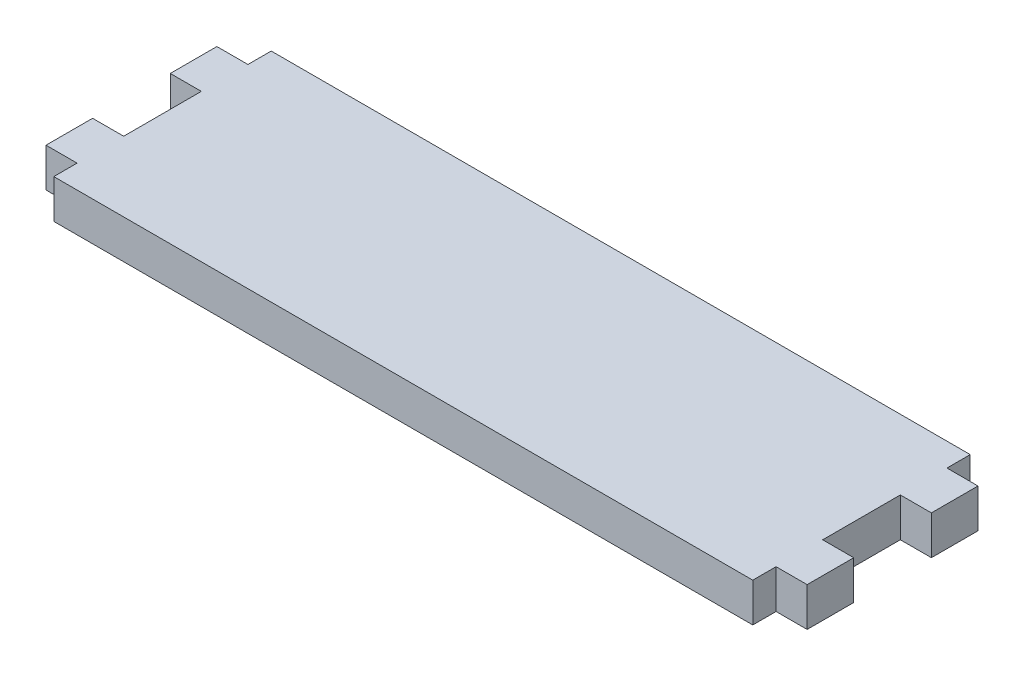
ISO-10303-21;
HEADER;
FILE_DESCRIPTION(('STEP AP214'),'2;1');
FILE_NAME('part.step','',(''),(''),'','','');
FILE_SCHEMA(('AUTOMOTIVE_DESIGN { 1 0 10303 214 1 1 1 1 }'));
ENDSEC;
DATA;
#1=APPLICATION_CONTEXT('core data for automotive mechanical design processes');
#2=APPLICATION_PROTOCOL_DEFINITION('international standard','automotive_design',2000,#1);
#3=PRODUCT_CONTEXT('',#1,'mechanical');
#4=PRODUCT('Part','Part','',(#3));
#5=PRODUCT_RELATED_PRODUCT_CATEGORY('part','',(#4));
#6=PRODUCT_DEFINITION_FORMATION('','',#4);
#7=PRODUCT_DEFINITION_CONTEXT('part definition',#1,'design');
#8=PRODUCT_DEFINITION('design','',#6,#7);
#9=PRODUCT_DEFINITION_SHAPE('','',#8);
#10=(LENGTH_UNIT() NAMED_UNIT(*) SI_UNIT(.MILLI.,.METRE.));
#11=(NAMED_UNIT(*) PLANE_ANGLE_UNIT() SI_UNIT($,.RADIAN.));
#12=(NAMED_UNIT(*) SI_UNIT($,.STERADIAN.) SOLID_ANGLE_UNIT());
#13=UNCERTAINTY_MEASURE_WITH_UNIT(LENGTH_MEASURE(1.E-05),#10,'distance_accuracy_value','');
#14=(GEOMETRIC_REPRESENTATION_CONTEXT(3) GLOBAL_UNCERTAINTY_ASSIGNED_CONTEXT((#13)) GLOBAL_UNIT_ASSIGNED_CONTEXT((#10,
#11,#12)) REPRESENTATION_CONTEXT('',''));
#15=CARTESIAN_POINT('',(0.,0.,0.));
#16=DIRECTION('',(0.,0.,1.));
#17=DIRECTION('',(1.,0.,0.));
#18=AXIS2_PLACEMENT_3D('',#15,#16,#17);
#19=CARTESIAN_POINT('',(90.,5.,0.));
#20=DIRECTION('',(0.,0.,-1.));
#21=DIRECTION('',(-1.,0.,0.));
#22=AXIS2_PLACEMENT_3D('',#19,#20,#21);
#23=PLANE('',#22);
#24=DIRECTION('',(1.,0.,0.));
#25=VECTOR('',#24,1.);
#26=CARTESIAN_POINT('',(90.,0.,0.));
#27=LINE('',#26,#25);
#28=CARTESIAN_POINT('',(0.,0.,0.));
#29=VERTEX_POINT('',#28);
#30=CARTESIAN_POINT('',(90.,0.,0.));
#31=VERTEX_POINT('',#30);
#32=EDGE_CURVE('E205',#29,#31,#27,.T.);
#33=ORIENTED_EDGE('',*,*,#32,.T.);
#34=DIRECTION('',(0.,-1.,0.));
#35=VECTOR('',#34,1.);
#36=CARTESIAN_POINT('',(90.,5.,0.));
#37=LINE('',#36,#35);
#38=CARTESIAN_POINT('',(90.,5.,0.));
#39=VERTEX_POINT('',#38);
#40=EDGE_CURVE('E11',#39,#31,#37,.T.);
#41=ORIENTED_EDGE('',*,*,#40,.F.);
#42=DIRECTION('',(1.,0.,0.));
#43=VECTOR('',#42,1.);
#44=CARTESIAN_POINT('',(90.,5.,0.));
#45=LINE('',#44,#43);
#46=CARTESIAN_POINT('',(0.,5.,0.));
#47=VERTEX_POINT('',#46);
#48=EDGE_CURVE('E243',#47,#39,#45,.T.);
#49=ORIENTED_EDGE('',*,*,#48,.F.);
#50=DIRECTION('',(0.,-1.,0.));
#51=VECTOR('',#50,1.);
#52=CARTESIAN_POINT('',(0.,5.,0.));
#53=LINE('',#52,#51);
#54=EDGE_CURVE('E201',#47,#29,#53,.T.);
#55=ORIENTED_EDGE('',*,*,#54,.T.);
#56=EDGE_LOOP('',(#33,#41,#49,#55));
#57=FACE_BOUND('',#56,.T.);
#58=ADVANCED_FACE('F37',(#57),#23,.F.);
#59=CARTESIAN_POINT('',(90.,5.,-3.));
#60=DIRECTION('',(-1.,0.,0.));
#61=DIRECTION('',(0.,0.,1.));
#62=AXIS2_PLACEMENT_3D('',#59,#60,#61);
#63=PLANE('',#62);
#64=DIRECTION('',(0.,0.,-1.));
#65=VECTOR('',#64,1.);
#66=CARTESIAN_POINT('',(90.,0.,-3.));
#67=LINE('',#66,#65);
#68=CARTESIAN_POINT('',(90.,0.,-3.));
#69=VERTEX_POINT('',#68);
#70=EDGE_CURVE('E208',#31,#69,#67,.T.);
#71=ORIENTED_EDGE('',*,*,#70,.T.);
#72=DIRECTION('',(0.,-1.,0.));
#73=VECTOR('',#72,1.);
#74=CARTESIAN_POINT('',(90.,5.,-3.));
#75=LINE('',#74,#73);
#76=CARTESIAN_POINT('',(90.,5.,-3.));
#77=VERTEX_POINT('',#76);
#78=EDGE_CURVE('E45',#77,#69,#75,.T.);
#79=ORIENTED_EDGE('',*,*,#78,.F.);
#80=DIRECTION('',(0.,0.,-1.));
#81=VECTOR('',#80,1.);
#82=CARTESIAN_POINT('',(90.,5.,-3.));
#83=LINE('',#82,#81);
#84=EDGE_CURVE('E132',#39,#77,#83,.T.);
#85=ORIENTED_EDGE('',*,*,#84,.F.);
#86=ORIENTED_EDGE('',*,*,#40,.T.);
#87=EDGE_LOOP('',(#71,#79,#85,#86));
#88=FACE_BOUND('',#87,.T.);
#89=ADVANCED_FACE('F361',(#88),#63,.F.);
#90=CARTESIAN_POINT('',(94.,5.,-3.));
#91=DIRECTION('',(0.,0.,-1.));
#92=DIRECTION('',(-1.,0.,0.));
#93=AXIS2_PLACEMENT_3D('',#90,#91,#92);
#94=PLANE('',#93);
#95=DIRECTION('',(1.,0.,0.));
#96=VECTOR('',#95,1.);
#97=CARTESIAN_POINT('',(94.,0.,-3.));
#98=LINE('',#97,#96);
#99=CARTESIAN_POINT('',(94.,0.,-3.));
#100=VERTEX_POINT('',#99);
#101=EDGE_CURVE('E210',#69,#100,#98,.T.);
#102=ORIENTED_EDGE('',*,*,#101,.T.);
#103=DIRECTION('',(0.,-1.,0.));
#104=VECTOR('',#103,1.);
#105=CARTESIAN_POINT('',(94.,5.,-3.));
#106=LINE('',#105,#104);
#107=CARTESIAN_POINT('',(94.,5.,-3.));
#108=VERTEX_POINT('',#107);
#109=EDGE_CURVE('E286',#108,#100,#106,.T.);
#110=ORIENTED_EDGE('',*,*,#109,.F.);
#111=DIRECTION('',(1.,0.,0.));
#112=VECTOR('',#111,1.);
#113=CARTESIAN_POINT('',(94.,5.,-3.));
#114=LINE('',#113,#112);
#115=EDGE_CURVE('E294',#77,#108,#114,.T.);
#116=ORIENTED_EDGE('',*,*,#115,.F.);
#117=ORIENTED_EDGE('',*,*,#78,.T.);
#118=EDGE_LOOP('',(#102,#110,#116,#117));
#119=FACE_BOUND('',#118,.T.);
#120=ADVANCED_FACE('F292',(#119),#94,.F.);
#121=CARTESIAN_POINT('',(94.,5.,-9.));
#122=DIRECTION('',(-1.,0.,0.));
#123=DIRECTION('',(0.,0.,1.));
#124=AXIS2_PLACEMENT_3D('',#121,#122,#123);
#125=PLANE('',#124);
#126=DIRECTION('',(0.,0.,-1.));
#127=VECTOR('',#126,1.);
#128=CARTESIAN_POINT('',(94.,0.,-9.));
#129=LINE('',#128,#127);
#130=CARTESIAN_POINT('',(94.,0.,-9.));
#131=VERTEX_POINT('',#130);
#132=EDGE_CURVE('E212',#100,#131,#129,.T.);
#133=ORIENTED_EDGE('',*,*,#132,.T.);
#134=DIRECTION('',(0.,-1.,0.));
#135=VECTOR('',#134,1.);
#136=CARTESIAN_POINT('',(94.,5.,-9.));
#137=LINE('',#136,#135);
#138=CARTESIAN_POINT('',(94.,5.,-9.));
#139=VERTEX_POINT('',#138);
#140=EDGE_CURVE('E283',#139,#131,#137,.T.);
#141=ORIENTED_EDGE('',*,*,#140,.F.);
#142=DIRECTION('',(0.,0.,-1.));
#143=VECTOR('',#142,1.);
#144=CARTESIAN_POINT('',(94.,5.,-9.));
#145=LINE('',#144,#143);
#146=EDGE_CURVE('E312',#108,#139,#145,.T.);
#147=ORIENTED_EDGE('',*,*,#146,.F.);
#148=ORIENTED_EDGE('',*,*,#109,.T.);
#149=EDGE_LOOP('',(#133,#141,#147,#148));
#150=FACE_BOUND('',#149,.T.);
#151=ADVANCED_FACE('F303',(#150),#125,.F.);
#152=CARTESIAN_POINT('',(90.,5.,-9.));
#153=DIRECTION('',(0.,0.,1.));
#154=DIRECTION('',(1.,0.,0.));
#155=AXIS2_PLACEMENT_3D('',#152,#153,#154);
#156=PLANE('',#155);
#157=DIRECTION('',(-1.,0.,0.));
#158=VECTOR('',#157,1.);
#159=CARTESIAN_POINT('',(90.,0.,-9.));
#160=LINE('',#159,#158);
#161=CARTESIAN_POINT('',(90.,0.,-9.));
#162=VERTEX_POINT('',#161);
#163=EDGE_CURVE('E214',#131,#162,#160,.T.);
#164=ORIENTED_EDGE('',*,*,#163,.T.);
#165=DIRECTION('',(0.,-1.,0.));
#166=VECTOR('',#165,1.);
#167=CARTESIAN_POINT('',(90.,5.,-9.));
#168=LINE('',#167,#166);
#169=CARTESIAN_POINT('',(90.,5.,-9.));
#170=VERTEX_POINT('',#169);
#171=EDGE_CURVE('E280',#170,#162,#168,.T.);
#172=ORIENTED_EDGE('',*,*,#171,.F.);
#173=DIRECTION('',(-1.,0.,0.));
#174=VECTOR('',#173,1.);
#175=CARTESIAN_POINT('',(90.,5.,-9.));
#176=LINE('',#175,#174);
#177=EDGE_CURVE('E309',#139,#170,#176,.T.);
#178=ORIENTED_EDGE('',*,*,#177,.F.);
#179=ORIENTED_EDGE('',*,*,#140,.T.);
#180=EDGE_LOOP('',(#164,#172,#178,#179));
#181=FACE_BOUND('',#180,.T.);
#182=ADVANCED_FACE('F307',(#181),#156,.F.);
#183=CARTESIAN_POINT('',(90.,5.,-19.));
#184=DIRECTION('',(-1.,0.,0.));
#185=DIRECTION('',(0.,0.,1.));
#186=AXIS2_PLACEMENT_3D('',#183,#184,#185);
#187=PLANE('',#186);
#188=DIRECTION('',(0.,0.,-1.));
#189=VECTOR('',#188,1.);
#190=CARTESIAN_POINT('',(90.,0.,-19.));
#191=LINE('',#190,#189);
#192=CARTESIAN_POINT('',(90.,0.,-19.));
#193=VERTEX_POINT('',#192);
#194=EDGE_CURVE('E216',#162,#193,#191,.T.);
#195=ORIENTED_EDGE('',*,*,#194,.T.);
#196=DIRECTION('',(0.,-1.,0.));
#197=VECTOR('',#196,1.);
#198=CARTESIAN_POINT('',(90.,5.,-19.));
#199=LINE('',#198,#197);
#200=CARTESIAN_POINT('',(90.,5.,-19.));
#201=VERTEX_POINT('',#200);
#202=EDGE_CURVE('E277',#201,#193,#199,.T.);
#203=ORIENTED_EDGE('',*,*,#202,.F.);
#204=DIRECTION('',(0.,0.,-1.));
#205=VECTOR('',#204,1.);
#206=CARTESIAN_POINT('',(90.,5.,-19.));
#207=LINE('',#206,#205);
#208=EDGE_CURVE('E311',#170,#201,#207,.T.);
#209=ORIENTED_EDGE('',*,*,#208,.F.);
#210=ORIENTED_EDGE('',*,*,#171,.T.);
#211=EDGE_LOOP('',(#195,#203,#209,#210));
#212=FACE_BOUND('',#211,.T.);
#213=ADVANCED_FACE('F374',(#212),#187,.F.);
#214=CARTESIAN_POINT('',(94.,5.,-19.));
#215=DIRECTION('',(0.,0.,-1.));
#216=DIRECTION('',(-1.,0.,0.));
#217=AXIS2_PLACEMENT_3D('',#214,#215,#216);
#218=PLANE('',#217);
#219=DIRECTION('',(1.,0.,0.));
#220=VECTOR('',#219,1.);
#221=CARTESIAN_POINT('',(94.,0.,-19.));
#222=LINE('',#221,#220);
#223=CARTESIAN_POINT('',(94.,0.,-19.));
#224=VERTEX_POINT('',#223);
#225=EDGE_CURVE('E218',#193,#224,#222,.T.);
#226=ORIENTED_EDGE('',*,*,#225,.T.);
#227=DIRECTION('',(0.,-1.,0.));
#228=VECTOR('',#227,1.);
#229=CARTESIAN_POINT('',(94.,5.,-19.));
#230=LINE('',#229,#228);
#231=CARTESIAN_POINT('',(94.,5.,-19.));
#232=VERTEX_POINT('',#231);
#233=EDGE_CURVE('E274',#232,#224,#230,.T.);
#234=ORIENTED_EDGE('',*,*,#233,.F.);
#235=DIRECTION('',(1.,0.,0.));
#236=VECTOR('',#235,1.);
#237=CARTESIAN_POINT('',(94.,5.,-19.));
#238=LINE('',#237,#236);
#239=EDGE_CURVE('E314',#201,#232,#238,.T.);
#240=ORIENTED_EDGE('',*,*,#239,.F.);
#241=ORIENTED_EDGE('',*,*,#202,.T.);
#242=EDGE_LOOP('',(#226,#234,#240,#241));
#243=FACE_BOUND('',#242,.T.);
#244=ADVANCED_FACE('F377',(#243),#218,.F.);
#245=CARTESIAN_POINT('',(94.,5.,-25.));
#246=DIRECTION('',(-1.,0.,0.));
#247=DIRECTION('',(0.,0.,1.));
#248=AXIS2_PLACEMENT_3D('',#245,#246,#247);
#249=PLANE('',#248);
#250=DIRECTION('',(0.,0.,-1.));
#251=VECTOR('',#250,1.);
#252=CARTESIAN_POINT('',(94.,0.,-25.));
#253=LINE('',#252,#251);
#254=CARTESIAN_POINT('',(94.,0.,-25.));
#255=VERTEX_POINT('',#254);
#256=EDGE_CURVE('E220',#224,#255,#253,.T.);
#257=ORIENTED_EDGE('',*,*,#256,.T.);
#258=DIRECTION('',(0.,-1.,0.));
#259=VECTOR('',#258,1.);
#260=CARTESIAN_POINT('',(94.,5.,-25.));
#261=LINE('',#260,#259);
#262=CARTESIAN_POINT('',(94.,5.,-25.));
#263=VERTEX_POINT('',#262);
#264=EDGE_CURVE('E271',#263,#255,#261,.T.);
#265=ORIENTED_EDGE('',*,*,#264,.F.);
#266=DIRECTION('',(0.,0.,-1.));
#267=VECTOR('',#266,1.);
#268=CARTESIAN_POINT('',(94.,5.,-25.));
#269=LINE('',#268,#267);
#270=EDGE_CURVE('E320',#232,#263,#269,.T.);
#271=ORIENTED_EDGE('',*,*,#270,.F.);
#272=ORIENTED_EDGE('',*,*,#233,.T.);
#273=EDGE_LOOP('',(#257,#265,#271,#272));
#274=FACE_BOUND('',#273,.T.);
#275=ADVANCED_FACE('F381',(#274),#249,.F.);
#276=CARTESIAN_POINT('',(90.,5.,-25.));
#277=DIRECTION('',(0.,0.,1.));
#278=DIRECTION('',(1.,0.,0.));
#279=AXIS2_PLACEMENT_3D('',#276,#277,#278);
#280=PLANE('',#279);
#281=DIRECTION('',(-1.,0.,0.));
#282=VECTOR('',#281,1.);
#283=CARTESIAN_POINT('',(90.,0.,-25.));
#284=LINE('',#283,#282);
#285=CARTESIAN_POINT('',(90.,0.,-25.));
#286=VERTEX_POINT('',#285);
#287=EDGE_CURVE('E222',#255,#286,#284,.T.);
#288=ORIENTED_EDGE('',*,*,#287,.T.);
#289=DIRECTION('',(0.,-1.,0.));
#290=VECTOR('',#289,1.);
#291=CARTESIAN_POINT('',(90.,5.,-25.));
#292=LINE('',#291,#290);
#293=CARTESIAN_POINT('',(90.,5.,-25.));
#294=VERTEX_POINT('',#293);
#295=EDGE_CURVE('E268',#294,#286,#292,.T.);
#296=ORIENTED_EDGE('',*,*,#295,.F.);
#297=DIRECTION('',(-1.,0.,0.));
#298=VECTOR('',#297,1.);
#299=CARTESIAN_POINT('',(90.,5.,-25.));
#300=LINE('',#299,#298);
#301=EDGE_CURVE('E322',#263,#294,#300,.T.);
#302=ORIENTED_EDGE('',*,*,#301,.F.);
#303=ORIENTED_EDGE('',*,*,#264,.T.);
#304=EDGE_LOOP('',(#288,#296,#302,#303));
#305=FACE_BOUND('',#304,.T.);
#306=ADVANCED_FACE('F385',(#305),#280,.F.);
#307=CARTESIAN_POINT('',(90.,5.,-28.));
#308=DIRECTION('',(-1.,0.,0.));
#309=DIRECTION('',(0.,0.,1.));
#310=AXIS2_PLACEMENT_3D('',#307,#308,#309);
#311=PLANE('',#310);
#312=DIRECTION('',(0.,0.,-1.));
#313=VECTOR('',#312,1.);
#314=CARTESIAN_POINT('',(90.,0.,-28.));
#315=LINE('',#314,#313);
#316=CARTESIAN_POINT('',(90.,0.,-28.));
#317=VERTEX_POINT('',#316);
#318=EDGE_CURVE('E224',#286,#317,#315,.T.);
#319=ORIENTED_EDGE('',*,*,#318,.T.);
#320=DIRECTION('',(0.,-1.,0.));
#321=VECTOR('',#320,1.);
#322=CARTESIAN_POINT('',(90.,5.,-28.));
#323=LINE('',#322,#321);
#324=CARTESIAN_POINT('',(90.,5.,-28.));
#325=VERTEX_POINT('',#324);
#326=EDGE_CURVE('E265',#325,#317,#323,.T.);
#327=ORIENTED_EDGE('',*,*,#326,.F.);
#328=DIRECTION('',(0.,0.,-1.));
#329=VECTOR('',#328,1.);
#330=CARTESIAN_POINT('',(90.,5.,-28.));
#331=LINE('',#330,#329);
#332=EDGE_CURVE('E324',#294,#325,#331,.T.);
#333=ORIENTED_EDGE('',*,*,#332,.F.);
#334=ORIENTED_EDGE('',*,*,#295,.T.);
#335=EDGE_LOOP('',(#319,#327,#333,#334));
#336=FACE_BOUND('',#335,.T.);
#337=ADVANCED_FACE('F389',(#336),#311,.F.);
#338=CARTESIAN_POINT('',(0.,5.,-28.));
#339=DIRECTION('',(0.,0.,1.));
#340=DIRECTION('',(1.,0.,0.));
#341=AXIS2_PLACEMENT_3D('',#338,#339,#340);
#342=PLANE('',#341);
#343=DIRECTION('',(-1.,0.,0.));
#344=VECTOR('',#343,1.);
#345=CARTESIAN_POINT('',(0.,0.,-28.));
#346=LINE('',#345,#344);
#347=CARTESIAN_POINT('',(0.,0.,-28.));
#348=VERTEX_POINT('',#347);
#349=EDGE_CURVE('E226',#317,#348,#346,.T.);
#350=ORIENTED_EDGE('',*,*,#349,.T.);
#351=DIRECTION('',(0.,-1.,0.));
#352=VECTOR('',#351,1.);
#353=CARTESIAN_POINT('',(0.,5.,-28.));
#354=LINE('',#353,#352);
#355=CARTESIAN_POINT('',(0.,5.,-28.));
#356=VERTEX_POINT('',#355);
#357=EDGE_CURVE('E262',#356,#348,#354,.T.);
#358=ORIENTED_EDGE('',*,*,#357,.F.);
#359=DIRECTION('',(-1.,0.,0.));
#360=VECTOR('',#359,1.);
#361=CARTESIAN_POINT('',(0.,5.,-28.));
#362=LINE('',#361,#360);
#363=EDGE_CURVE('E326',#325,#356,#362,.T.);
#364=ORIENTED_EDGE('',*,*,#363,.F.);
#365=ORIENTED_EDGE('',*,*,#326,.T.);
#366=EDGE_LOOP('',(#350,#358,#364,#365));
#367=FACE_BOUND('',#366,.T.);
#368=ADVANCED_FACE('F393',(#367),#342,.F.);
#369=CARTESIAN_POINT('',(0.,5.,-25.));
#370=DIRECTION('',(1.,0.,0.));
#371=DIRECTION('',(0.,0.,-1.));
#372=AXIS2_PLACEMENT_3D('',#369,#370,#371);
#373=PLANE('',#372);
#374=DIRECTION('',(0.,0.,1.));
#375=VECTOR('',#374,1.);
#376=CARTESIAN_POINT('',(0.,0.,-25.));
#377=LINE('',#376,#375);
#378=CARTESIAN_POINT('',(0.,0.,-25.));
#379=VERTEX_POINT('',#378);
#380=EDGE_CURVE('E228',#348,#379,#377,.T.);
#381=ORIENTED_EDGE('',*,*,#380,.T.);
#382=DIRECTION('',(0.,-1.,0.));
#383=VECTOR('',#382,1.);
#384=CARTESIAN_POINT('',(0.,5.,-25.));
#385=LINE('',#384,#383);
#386=CARTESIAN_POINT('',(0.,5.,-25.));
#387=VERTEX_POINT('',#386);
#388=EDGE_CURVE('E259',#387,#379,#385,.T.);
#389=ORIENTED_EDGE('',*,*,#388,.F.);
#390=DIRECTION('',(0.,0.,1.));
#391=VECTOR('',#390,1.);
#392=CARTESIAN_POINT('',(0.,5.,-25.));
#393=LINE('',#392,#391);
#394=EDGE_CURVE('E328',#356,#387,#393,.T.);
#395=ORIENTED_EDGE('',*,*,#394,.F.);
#396=ORIENTED_EDGE('',*,*,#357,.T.);
#397=EDGE_LOOP('',(#381,#389,#395,#396));
#398=FACE_BOUND('',#397,.T.);
#399=ADVANCED_FACE('F397',(#398),#373,.F.);
#400=CARTESIAN_POINT('',(-4.,5.,-25.));
#401=DIRECTION('',(0.,0.,1.));
#402=DIRECTION('',(1.,0.,0.));
#403=AXIS2_PLACEMENT_3D('',#400,#401,#402);
#404=PLANE('',#403);
#405=DIRECTION('',(-1.,0.,0.));
#406=VECTOR('',#405,1.);
#407=CARTESIAN_POINT('',(-4.,0.,-25.));
#408=LINE('',#407,#406);
#409=CARTESIAN_POINT('',(-4.,0.,-25.));
#410=VERTEX_POINT('',#409);
#411=EDGE_CURVE('E230',#379,#410,#408,.T.);
#412=ORIENTED_EDGE('',*,*,#411,.T.);
#413=DIRECTION('',(0.,-1.,0.));
#414=VECTOR('',#413,1.);
#415=CARTESIAN_POINT('',(-4.,5.,-25.));
#416=LINE('',#415,#414);
#417=CARTESIAN_POINT('',(-4.,5.,-25.));
#418=VERTEX_POINT('',#417);
#419=EDGE_CURVE('E256',#418,#410,#416,.T.);
#420=ORIENTED_EDGE('',*,*,#419,.F.);
#421=DIRECTION('',(-1.,0.,0.));
#422=VECTOR('',#421,1.);
#423=CARTESIAN_POINT('',(-4.,5.,-25.));
#424=LINE('',#423,#422);
#425=EDGE_CURVE('E330',#387,#418,#424,.T.);
#426=ORIENTED_EDGE('',*,*,#425,.F.);
#427=ORIENTED_EDGE('',*,*,#388,.T.);
#428=EDGE_LOOP('',(#412,#420,#426,#427));
#429=FACE_BOUND('',#428,.T.);
#430=ADVANCED_FACE('F401',(#429),#404,.F.);
#431=CARTESIAN_POINT('',(-4.,5.,-19.));
#432=DIRECTION('',(1.,0.,0.));
#433=DIRECTION('',(0.,0.,-1.));
#434=AXIS2_PLACEMENT_3D('',#431,#432,#433);
#435=PLANE('',#434);
#436=DIRECTION('',(0.,0.,1.));
#437=VECTOR('',#436,1.);
#438=CARTESIAN_POINT('',(-4.,0.,-19.));
#439=LINE('',#438,#437);
#440=CARTESIAN_POINT('',(-4.,0.,-19.));
#441=VERTEX_POINT('',#440);
#442=EDGE_CURVE('E232',#410,#441,#439,.T.);
#443=ORIENTED_EDGE('',*,*,#442,.T.);
#444=DIRECTION('',(0.,-1.,0.));
#445=VECTOR('',#444,1.);
#446=CARTESIAN_POINT('',(-4.,5.,-19.));
#447=LINE('',#446,#445);
#448=CARTESIAN_POINT('',(-4.,5.,-19.));
#449=VERTEX_POINT('',#448);
#450=EDGE_CURVE('E253',#449,#441,#447,.T.);
#451=ORIENTED_EDGE('',*,*,#450,.F.);
#452=DIRECTION('',(0.,0.,1.));
#453=VECTOR('',#452,1.);
#454=CARTESIAN_POINT('',(-4.,5.,-19.));
#455=LINE('',#454,#453);
#456=EDGE_CURVE('E332',#418,#449,#455,.T.);
#457=ORIENTED_EDGE('',*,*,#456,.F.);
#458=ORIENTED_EDGE('',*,*,#419,.T.);
#459=EDGE_LOOP('',(#443,#451,#457,#458));
#460=FACE_BOUND('',#459,.T.);
#461=ADVANCED_FACE('F405',(#460),#435,.F.);
#462=CARTESIAN_POINT('',(0.,5.,-19.));
#463=DIRECTION('',(0.,0.,-1.));
#464=DIRECTION('',(-1.,0.,0.));
#465=AXIS2_PLACEMENT_3D('',#462,#463,#464);
#466=PLANE('',#465);
#467=DIRECTION('',(1.,0.,0.));
#468=VECTOR('',#467,1.);
#469=CARTESIAN_POINT('',(0.,0.,-19.));
#470=LINE('',#469,#468);
#471=CARTESIAN_POINT('',(0.,0.,-19.));
#472=VERTEX_POINT('',#471);
#473=EDGE_CURVE('E234',#441,#472,#470,.T.);
#474=ORIENTED_EDGE('',*,*,#473,.T.);
#475=DIRECTION('',(0.,-1.,0.));
#476=VECTOR('',#475,1.);
#477=CARTESIAN_POINT('',(0.,5.,-19.));
#478=LINE('',#477,#476);
#479=CARTESIAN_POINT('',(0.,5.,-19.));
#480=VERTEX_POINT('',#479);
#481=EDGE_CURVE('E250',#480,#472,#478,.T.);
#482=ORIENTED_EDGE('',*,*,#481,.F.);
#483=DIRECTION('',(1.,0.,0.));
#484=VECTOR('',#483,1.);
#485=CARTESIAN_POINT('',(0.,5.,-19.));
#486=LINE('',#485,#484);
#487=EDGE_CURVE('E334',#449,#480,#486,.T.);
#488=ORIENTED_EDGE('',*,*,#487,.F.);
#489=ORIENTED_EDGE('',*,*,#450,.T.);
#490=EDGE_LOOP('',(#474,#482,#488,#489));
#491=FACE_BOUND('',#490,.T.);
#492=ADVANCED_FACE('F409',(#491),#466,.F.);
#493=CARTESIAN_POINT('',(0.,5.,-9.));
#494=DIRECTION('',(1.,0.,0.));
#495=DIRECTION('',(0.,0.,-1.));
#496=AXIS2_PLACEMENT_3D('',#493,#494,#495);
#497=PLANE('',#496);
#498=DIRECTION('',(0.,0.,1.));
#499=VECTOR('',#498,1.);
#500=CARTESIAN_POINT('',(0.,0.,-9.));
#501=LINE('',#500,#499);
#502=CARTESIAN_POINT('',(0.,0.,-9.));
#503=VERTEX_POINT('',#502);
#504=EDGE_CURVE('E236',#472,#503,#501,.T.);
#505=ORIENTED_EDGE('',*,*,#504,.T.);
#506=DIRECTION('',(0.,-1.,0.));
#507=VECTOR('',#506,1.);
#508=CARTESIAN_POINT('',(0.,5.,-9.));
#509=LINE('',#508,#507);
#510=CARTESIAN_POINT('',(0.,5.,-9.));
#511=VERTEX_POINT('',#510);
#512=EDGE_CURVE('E247',#511,#503,#509,.T.);
#513=ORIENTED_EDGE('',*,*,#512,.F.);
#514=DIRECTION('',(0.,0.,1.));
#515=VECTOR('',#514,1.);
#516=CARTESIAN_POINT('',(0.,5.,-9.));
#517=LINE('',#516,#515);
#518=EDGE_CURVE('E336',#480,#511,#517,.T.);
#519=ORIENTED_EDGE('',*,*,#518,.F.);
#520=ORIENTED_EDGE('',*,*,#481,.T.);
#521=EDGE_LOOP('',(#505,#513,#519,#520));
#522=FACE_BOUND('',#521,.T.);
#523=ADVANCED_FACE('F342',(#522),#497,.F.);
#524=CARTESIAN_POINT('',(-4.,5.,-9.));
#525=DIRECTION('',(0.,0.,1.));
#526=DIRECTION('',(1.,0.,0.));
#527=AXIS2_PLACEMENT_3D('',#524,#525,#526);
#528=PLANE('',#527);
#529=DIRECTION('',(-1.,0.,0.));
#530=VECTOR('',#529,1.);
#531=CARTESIAN_POINT('',(-4.,0.,-9.));
#532=LINE('',#531,#530);
#533=CARTESIAN_POINT('',(-4.,0.,-9.));
#534=VERTEX_POINT('',#533);
#535=EDGE_CURVE('E238',#503,#534,#532,.T.);
#536=ORIENTED_EDGE('',*,*,#535,.T.);
#537=DIRECTION('',(0.,-1.,0.));
#538=VECTOR('',#537,1.);
#539=CARTESIAN_POINT('',(-4.,5.,-9.));
#540=LINE('',#539,#538);
#541=CARTESIAN_POINT('',(-4.,5.,-9.));
#542=VERTEX_POINT('',#541);
#543=EDGE_CURVE('E196',#542,#534,#540,.T.);
#544=ORIENTED_EDGE('',*,*,#543,.F.);
#545=DIRECTION('',(-1.,0.,0.));
#546=VECTOR('',#545,1.);
#547=CARTESIAN_POINT('',(-4.,5.,-9.));
#548=LINE('',#547,#546);
#549=EDGE_CURVE('E187',#511,#542,#548,.T.);
#550=ORIENTED_EDGE('',*,*,#549,.F.);
#551=ORIENTED_EDGE('',*,*,#512,.T.);
#552=EDGE_LOOP('',(#536,#544,#550,#551));
#553=FACE_BOUND('',#552,.T.);
#554=ADVANCED_FACE('F346',(#553),#528,.F.);
#555=CARTESIAN_POINT('',(-4.,5.,-3.));
#556=DIRECTION('',(1.,0.,0.));
#557=DIRECTION('',(0.,0.,-1.));
#558=AXIS2_PLACEMENT_3D('',#555,#556,#557);
#559=PLANE('',#558);
#560=DIRECTION('',(0.,0.,1.));
#561=VECTOR('',#560,1.);
#562=CARTESIAN_POINT('',(-4.,0.,-3.));
#563=LINE('',#562,#561);
#564=CARTESIAN_POINT('',(-4.,0.,-3.));
#565=VERTEX_POINT('',#564);
#566=EDGE_CURVE('E195',#534,#565,#563,.T.);
#567=ORIENTED_EDGE('',*,*,#566,.T.);
#568=DIRECTION('',(0.,-1.,0.));
#569=VECTOR('',#568,1.);
#570=CARTESIAN_POINT('',(-4.,5.,-3.));
#571=LINE('',#570,#569);
#572=CARTESIAN_POINT('',(-4.,5.,-3.));
#573=VERTEX_POINT('',#572);
#574=EDGE_CURVE('E192',#573,#565,#571,.T.);
#575=ORIENTED_EDGE('',*,*,#574,.F.);
#576=DIRECTION('',(0.,0.,1.));
#577=VECTOR('',#576,1.);
#578=CARTESIAN_POINT('',(-4.,5.,-3.));
#579=LINE('',#578,#577);
#580=EDGE_CURVE('E181',#542,#573,#579,.T.);
#581=ORIENTED_EDGE('',*,*,#580,.F.);
#582=ORIENTED_EDGE('',*,*,#543,.T.);
#583=EDGE_LOOP('',(#567,#575,#581,#582));
#584=FACE_BOUND('',#583,.T.);
#585=ADVANCED_FACE('F193',(#584),#559,.F.);
#586=CARTESIAN_POINT('',(0.,5.,-3.));
#587=DIRECTION('',(0.,0.,-1.));
#588=DIRECTION('',(-1.,0.,0.));
#589=AXIS2_PLACEMENT_3D('',#586,#587,#588);
#590=PLANE('',#589);
#591=DIRECTION('',(1.,0.,0.));
#592=VECTOR('',#591,1.);
#593=CARTESIAN_POINT('',(0.,0.,-3.));
#594=LINE('',#593,#592);
#595=CARTESIAN_POINT('',(0.,0.,-3.));
#596=VERTEX_POINT('',#595);
#597=EDGE_CURVE('E118',#565,#596,#594,.T.);
#598=ORIENTED_EDGE('',*,*,#597,.T.);
#599=DIRECTION('',(0.,-1.,0.));
#600=VECTOR('',#599,1.);
#601=CARTESIAN_POINT('',(0.,5.,-3.));
#602=LINE('',#601,#600);
#603=CARTESIAN_POINT('',(0.,5.,-3.));
#604=VERTEX_POINT('',#603);
#605=EDGE_CURVE('E197',#604,#596,#602,.T.);
#606=ORIENTED_EDGE('',*,*,#605,.F.);
#607=DIRECTION('',(1.,0.,0.));
#608=VECTOR('',#607,1.);
#609=CARTESIAN_POINT('',(0.,5.,-3.));
#610=LINE('',#609,#608);
#611=EDGE_CURVE('E185',#573,#604,#610,.T.);
#612=ORIENTED_EDGE('',*,*,#611,.F.);
#613=ORIENTED_EDGE('',*,*,#574,.T.);
#614=EDGE_LOOP('',(#598,#606,#612,#613));
#615=FACE_BOUND('',#614,.T.);
#616=ADVANCED_FACE('F199',(#615),#590,.F.);
#617=CARTESIAN_POINT('',(0.,5.,0.));
#618=DIRECTION('',(1.,0.,0.));
#619=DIRECTION('',(0.,0.,-1.));
#620=AXIS2_PLACEMENT_3D('',#617,#618,#619);
#621=PLANE('',#620);
#622=DIRECTION('',(0.,0.,1.));
#623=VECTOR('',#622,1.);
#624=CARTESIAN_POINT('',(0.,0.,0.));
#625=LINE('',#624,#623);
#626=EDGE_CURVE('E124',#596,#29,#625,.T.);
#627=ORIENTED_EDGE('',*,*,#626,.T.);
#628=ORIENTED_EDGE('',*,*,#54,.F.);
#629=DIRECTION('',(0.,0.,1.));
#630=VECTOR('',#629,1.);
#631=CARTESIAN_POINT('',(0.,5.,0.));
#632=LINE('',#631,#630);
#633=EDGE_CURVE('E53',#604,#47,#632,.T.);
#634=ORIENTED_EDGE('',*,*,#633,.F.);
#635=ORIENTED_EDGE('',*,*,#605,.T.);
#636=EDGE_LOOP('',(#627,#628,#634,#635));
#637=FACE_BOUND('',#636,.T.);
#638=ADVANCED_FACE('F350',(#637),#621,.F.);
#639=CARTESIAN_POINT('',(0.,5.,0.));
#640=DIRECTION('',(0.,-1.,0.));
#641=DIRECTION('',(0.,0.,-1.));
#642=AXIS2_PLACEMENT_3D('',#639,#640,#641);
#643=PLANE('',#642);
#644=ORIENTED_EDGE('',*,*,#48,.T.);
#645=ORIENTED_EDGE('',*,*,#84,.T.);
#646=ORIENTED_EDGE('',*,*,#115,.T.);
#647=ORIENTED_EDGE('',*,*,#146,.T.);
#648=ORIENTED_EDGE('',*,*,#177,.T.);
#649=ORIENTED_EDGE('',*,*,#208,.T.);
#650=ORIENTED_EDGE('',*,*,#239,.T.);
#651=ORIENTED_EDGE('',*,*,#270,.T.);
#652=ORIENTED_EDGE('',*,*,#301,.T.);
#653=ORIENTED_EDGE('',*,*,#332,.T.);
#654=ORIENTED_EDGE('',*,*,#363,.T.);
#655=ORIENTED_EDGE('',*,*,#394,.T.);
#656=ORIENTED_EDGE('',*,*,#425,.T.);
#657=ORIENTED_EDGE('',*,*,#456,.T.);
#658=ORIENTED_EDGE('',*,*,#487,.T.);
#659=ORIENTED_EDGE('',*,*,#518,.T.);
#660=ORIENTED_EDGE('',*,*,#549,.T.);
#661=ORIENTED_EDGE('',*,*,#580,.T.);
#662=ORIENTED_EDGE('',*,*,#611,.T.);
#663=ORIENTED_EDGE('',*,*,#633,.T.);
#664=EDGE_LOOP('',(#644,#645,#646,#647,#648,#649,#650,#651,#652,#653,#654,#655,#656,#657,#658,
#659,#660,#661,#662,#663));
#665=FACE_BOUND('',#664,.T.);
#666=ADVANCED_FACE('F183',(#665),#643,.F.);
#667=CARTESIAN_POINT('',(0.,0.,0.));
#668=DIRECTION('',(0.,-1.,0.));
#669=DIRECTION('',(0.,0.,-1.));
#670=AXIS2_PLACEMENT_3D('',#667,#668,#669);
#671=PLANE('',#670);
#672=ORIENTED_EDGE('',*,*,#32,.F.);
#673=ORIENTED_EDGE('',*,*,#626,.F.);
#674=ORIENTED_EDGE('',*,*,#597,.F.);
#675=ORIENTED_EDGE('',*,*,#566,.F.);
#676=ORIENTED_EDGE('',*,*,#535,.F.);
#677=ORIENTED_EDGE('',*,*,#504,.F.);
#678=ORIENTED_EDGE('',*,*,#473,.F.);
#679=ORIENTED_EDGE('',*,*,#442,.F.);
#680=ORIENTED_EDGE('',*,*,#411,.F.);
#681=ORIENTED_EDGE('',*,*,#380,.F.);
#682=ORIENTED_EDGE('',*,*,#349,.F.);
#683=ORIENTED_EDGE('',*,*,#318,.F.);
#684=ORIENTED_EDGE('',*,*,#287,.F.);
#685=ORIENTED_EDGE('',*,*,#256,.F.);
#686=ORIENTED_EDGE('',*,*,#225,.F.);
#687=ORIENTED_EDGE('',*,*,#194,.F.);
#688=ORIENTED_EDGE('',*,*,#163,.F.);
#689=ORIENTED_EDGE('',*,*,#132,.F.);
#690=ORIENTED_EDGE('',*,*,#101,.F.);
#691=ORIENTED_EDGE('',*,*,#70,.F.);
#692=EDGE_LOOP('',(#672,#673,#674,#675,#676,#677,#678,#679,#680,#681,#682,#683,#684,#685,#686,
#687,#688,#689,#690,#691));
#693=FACE_BOUND('',#692,.T.);
#694=ADVANCED_FACE('F298',(#693),#671,.T.);
#695=CLOSED_SHELL('',(#58,#89,#120,#151,#182,#213,#244,#275,#306,#337,#368,#399,#430,#461,#492,
#523,#554,#585,#616,#638,#666,#694));
#696=MANIFOLD_SOLID_BREP('B2',#695);
#697=ADVANCED_BREP_SHAPE_REPRESENTATION('',(#18,#696),#14);
#698=SHAPE_DEFINITION_REPRESENTATION(#9,#697);
ENDSEC;
END-ISO-10303-21;
